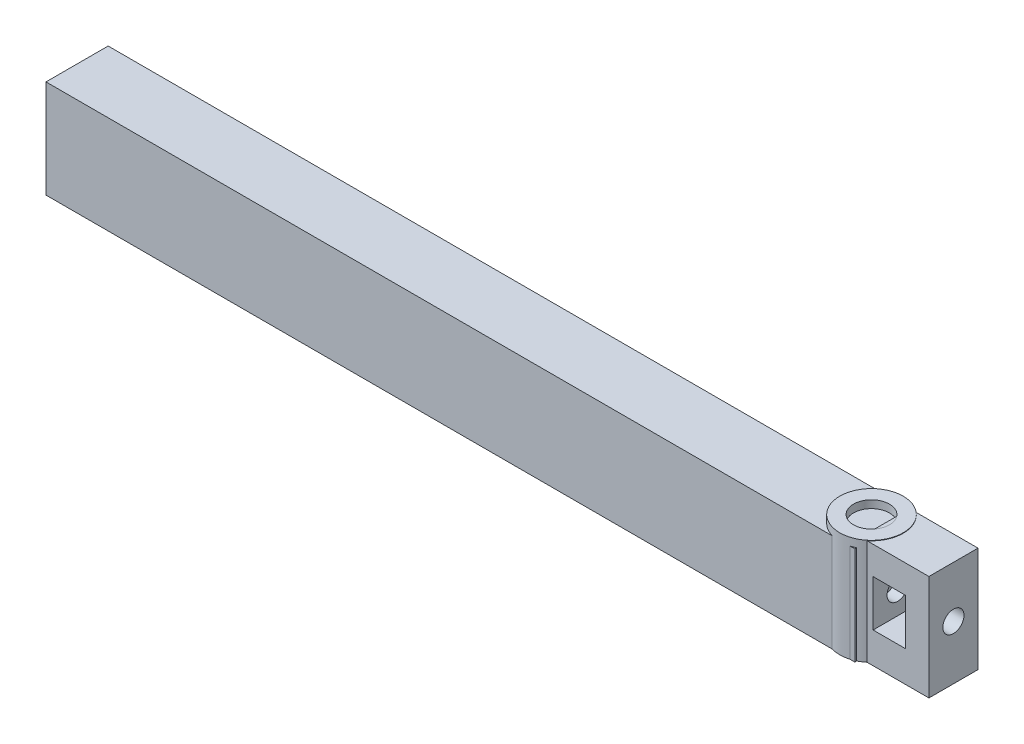
ISO-10303-21;
HEADER;
FILE_DESCRIPTION(('STEP AP214'),'2;1');
FILE_NAME('part.step','',(''),(''),'','','');
FILE_SCHEMA(('AUTOMOTIVE_DESIGN { 1 0 10303 214 1 1 1 1 }'));
ENDSEC;
DATA;
#1=APPLICATION_CONTEXT('core data for automotive mechanical design processes');
#2=APPLICATION_PROTOCOL_DEFINITION('international standard','automotive_design',2000,#1);
#3=PRODUCT_CONTEXT('',#1,'mechanical');
#4=PRODUCT('Part','Part','',(#3));
#5=PRODUCT_RELATED_PRODUCT_CATEGORY('part','',(#4));
#6=PRODUCT_DEFINITION_FORMATION('','',#4);
#7=PRODUCT_DEFINITION_CONTEXT('part definition',#1,'design');
#8=PRODUCT_DEFINITION('design','',#6,#7);
#9=PRODUCT_DEFINITION_SHAPE('','',#8);
#10=(LENGTH_UNIT() NAMED_UNIT(*) SI_UNIT(.MILLI.,.METRE.));
#11=(NAMED_UNIT(*) PLANE_ANGLE_UNIT() SI_UNIT($,.RADIAN.));
#12=(NAMED_UNIT(*) SI_UNIT($,.STERADIAN.) SOLID_ANGLE_UNIT());
#13=UNCERTAINTY_MEASURE_WITH_UNIT(LENGTH_MEASURE(1.E-05),#10,'distance_accuracy_value','');
#14=(GEOMETRIC_REPRESENTATION_CONTEXT(3) GLOBAL_UNCERTAINTY_ASSIGNED_CONTEXT((#13)) GLOBAL_UNIT_ASSIGNED_CONTEXT((#10,
#11,#12)) REPRESENTATION_CONTEXT('',''));
#15=CARTESIAN_POINT('',(0.,0.,0.));
#16=DIRECTION('',(0.,0.,1.));
#17=DIRECTION('',(1.,0.,0.));
#18=AXIS2_PLACEMENT_3D('',#15,#16,#17);
#19=CARTESIAN_POINT('',(0.,20.,0.));
#20=DIRECTION('',(0.,-1.,0.));
#21=DIRECTION('',(0.,0.,-1.));
#22=AXIS2_PLACEMENT_3D('',#19,#20,#21);
#23=CYLINDRICAL_SURFACE('',#22,6.);
#24=CARTESIAN_POINT('',(0.,20.,0.));
#25=DIRECTION('',(0.,1.,0.));
#26=DIRECTION('',(0.,0.,1.));
#27=AXIS2_PLACEMENT_3D('',#24,#25,#26);
#28=CIRCLE('',#27,6.);
#29=CARTESIAN_POINT('',(0.,20.,6.));
#30=VERTEX_POINT('',#29);
#31=EDGE_CURVE('E297',#30,#30,#28,.T.);
#32=ORIENTED_EDGE('',*,*,#31,.F.);
#33=EDGE_LOOP('',(#32));
#34=FACE_BOUND('',#33,.T.);
#35=DIRECTION('',(0.,-1.,0.));
#36=VECTOR('',#35,1.);
#37=CARTESIAN_POINT('',(-0.306093006545225,20.,-5.99218716925165));
#38=LINE('',#37,#36);
#39=CARTESIAN_POINT('',(-0.306093006545225,18.5514177143489,-5.99218716925165));
#40=VERTEX_POINT('',#39);
#41=CARTESIAN_POINT('',(-0.30609300654528,0.,-5.99218716925165));
#42=VERTEX_POINT('',#41);
#43=EDGE_CURVE('E195',#40,#42,#38,.T.);
#44=ORIENTED_EDGE('',*,*,#43,.F.);
#45=CARTESIAN_POINT('',(0.,18.5514177143489,0.));
#46=DIRECTION('',(0.,-1.,0.));
#47=DIRECTION('',(0.,0.,-1.));
#48=AXIS2_PLACEMENT_3D('',#45,#46,#47);
#49=CIRCLE('',#48,6.);
#50=CARTESIAN_POINT('',(-1.66626200895293,18.5514177143489,5.76398914967058));
#51=VERTEX_POINT('',#50);
#52=EDGE_CURVE('E49',#51,#40,#49,.T.);
#53=ORIENTED_EDGE('',*,*,#52,.F.);
#54=DIRECTION('',(0.,-1.,0.));
#55=VECTOR('',#54,1.);
#56=CARTESIAN_POINT('',(-1.66626200895293,20.,5.76398914967058));
#57=LINE('',#56,#55);
#58=CARTESIAN_POINT('',(-1.66626200895293,0.,5.76398914967058));
#59=VERTEX_POINT('',#58);
#60=EDGE_CURVE('E211',#59,#51,#57,.F.);
#61=ORIENTED_EDGE('',*,*,#60,.F.);
#62=CARTESIAN_POINT('',(0.,0.,0.));
#63=DIRECTION('',(0.,1.,0.));
#64=DIRECTION('',(0.,0.,1.));
#65=AXIS2_PLACEMENT_3D('',#62,#63,#64);
#66=CIRCLE('',#65,6.);
#67=CARTESIAN_POINT('',(1.66626200895293,0.,5.76398914967058));
#68=VERTEX_POINT('',#67);
#69=EDGE_CURVE('E399',#59,#68,#66,.T.);
#70=ORIENTED_EDGE('',*,*,#69,.T.);
#71=DIRECTION('',(0.,-1.,0.));
#72=VECTOR('',#71,1.);
#73=CARTESIAN_POINT('',(1.66626200895293,20.,5.76398914967058));
#74=LINE('',#73,#72);
#75=CARTESIAN_POINT('',(1.66626200895293,18.5514177143489,5.76398914967058));
#76=VERTEX_POINT('',#75);
#77=EDGE_CURVE('E213',#76,#68,#74,.T.);
#78=ORIENTED_EDGE('',*,*,#77,.F.);
#79=CARTESIAN_POINT('',(2.6,18.5514177143489,5.40740233383831));
#80=VERTEX_POINT('',#79);
#81=EDGE_CURVE('E204',#80,#76,#49,.T.);
#82=ORIENTED_EDGE('',*,*,#81,.F.);
#83=DIRECTION('',(0.,-1.,0.));
#84=VECTOR('',#83,1.);
#85=CARTESIAN_POINT('',(2.6,20.,5.40740233383831));
#86=LINE('',#85,#84);
#87=CARTESIAN_POINT('',(2.6,0.,5.40740233383831));
#88=VERTEX_POINT('',#87);
#89=EDGE_CURVE('E205',#88,#80,#86,.F.);
#90=ORIENTED_EDGE('',*,*,#89,.F.);
#91=CARTESIAN_POINT('',(3.80639618584468,0.,4.63803278086594));
#92=VERTEX_POINT('',#91);
#93=EDGE_CURVE('E296',#88,#92,#66,.T.);
#94=ORIENTED_EDGE('',*,*,#93,.T.);
#95=DIRECTION('',(0.,-1.,0.));
#96=VECTOR('',#95,1.);
#97=CARTESIAN_POINT('',(3.80639618584469,20.,4.63803278086594));
#98=LINE('',#97,#96);
#99=CARTESIAN_POINT('',(3.80639618584469,19.9099600410235,4.63803278086594));
#100=VERTEX_POINT('',#99);
#101=EDGE_CURVE('E283',#92,#100,#98,.F.);
#102=ORIENTED_EDGE('',*,*,#101,.T.);
#103=CARTESIAN_POINT('',(0.,19.9099600410235,0.));
#104=DIRECTION('',(0.,1.,0.));
#105=DIRECTION('',(0.,0.,1.));
#106=AXIS2_PLACEMENT_3D('',#103,#104,#105);
#107=CIRCLE('',#106,6.);
#108=CARTESIAN_POINT('',(3.79364393830497,19.9099600410235,-4.64846917483186));
#109=VERTEX_POINT('',#108);
#110=EDGE_CURVE('E273',#100,#109,#107,.T.);
#111=ORIENTED_EDGE('',*,*,#110,.T.);
#112=DIRECTION('',(0.,-1.,0.));
#113=VECTOR('',#112,1.);
#114=CARTESIAN_POINT('',(3.79364393830497,20.,-4.64846917483186));
#115=LINE('',#114,#113);
#116=CARTESIAN_POINT('',(3.79364393830497,0.,-4.64846917483186));
#117=VERTEX_POINT('',#116);
#118=EDGE_CURVE('E285',#109,#117,#115,.T.);
#119=ORIENTED_EDGE('',*,*,#118,.T.);
#120=CARTESIAN_POINT('',(2.6,0.,-5.40740233383831));
#121=VERTEX_POINT('',#120);
#122=EDGE_CURVE('E301',#117,#121,#66,.T.);
#123=ORIENTED_EDGE('',*,*,#122,.T.);
#124=DIRECTION('',(0.,-1.,0.));
#125=VECTOR('',#124,1.);
#126=CARTESIAN_POINT('',(2.6,20.,-5.40740233383831));
#127=LINE('',#126,#125);
#128=CARTESIAN_POINT('',(2.6,18.5514177143489,-5.40740233383831));
#129=VERTEX_POINT('',#128);
#130=EDGE_CURVE('E208',#129,#121,#127,.T.);
#131=ORIENTED_EDGE('',*,*,#130,.F.);
#132=CARTESIAN_POINT('',(0.306093006545225,18.5514177143489,-5.99218716925165));
#133=VERTEX_POINT('',#132);
#134=EDGE_CURVE('E56',#133,#129,#49,.T.);
#135=ORIENTED_EDGE('',*,*,#134,.F.);
#136=DIRECTION('',(0.,-1.,0.));
#137=VECTOR('',#136,1.);
#138=CARTESIAN_POINT('',(0.306093006545225,20.,-5.99218716925165));
#139=LINE('',#138,#137);
#140=CARTESIAN_POINT('',(0.30609300654528,0.,-5.99218716925165));
#141=VERTEX_POINT('',#140);
#142=EDGE_CURVE('E216',#141,#133,#139,.F.);
#143=ORIENTED_EDGE('',*,*,#142,.F.);
#144=EDGE_CURVE('E303',#141,#42,#66,.T.);
#145=ORIENTED_EDGE('',*,*,#144,.T.);
#146=EDGE_LOOP('',(#44,#53,#61,#70,#78,#82,#90,#94,#102,#111,#119,#123,#131,#135,#143,#145));
#147=FACE_BOUND('',#146,.T.);
#148=ADVANCED_FACE('F35',(#34,#147),#23,.T.);
#149=CARTESIAN_POINT('',(0.,6.45,0.));
#150=DIRECTION('',(0.,1.,0.));
#151=DIRECTION('',(0.,0.,1.));
#152=AXIS2_PLACEMENT_3D('',#149,#150,#151);
#153=CYLINDRICAL_SURFACE('',#152,3.4);
#154=CARTESIAN_POINT('',(0.,20.,0.));
#155=DIRECTION('',(0.,1.,0.));
#156=DIRECTION('',(0.,0.,1.));
#157=AXIS2_PLACEMENT_3D('',#154,#155,#156);
#158=CIRCLE('',#157,3.4);
#159=CARTESIAN_POINT('',(0.,20.,3.4));
#160=VERTEX_POINT('',#159);
#161=EDGE_CURVE('E293',#160,#160,#158,.T.);
#162=ORIENTED_EDGE('',*,*,#161,.T.);
#163=EDGE_LOOP('',(#162));
#164=FACE_BOUND('',#163,.T.);
#165=CARTESIAN_POINT('',(0.,18.5514177143489,0.));
#166=DIRECTION('',(0.,-1.,0.));
#167=DIRECTION('',(0.,0.,-1.));
#168=AXIS2_PLACEMENT_3D('',#165,#166,#167);
#169=CIRCLE('',#168,3.4);
#170=CARTESIAN_POINT('',(2.6,18.5514177143489,-2.19089023002067));
#171=VERTEX_POINT('',#170);
#172=CARTESIAN_POINT('',(2.6,18.5514177143489,2.19089023002067));
#173=VERTEX_POINT('',#172);
#174=EDGE_CURVE('E196',#171,#173,#169,.F.);
#175=ORIENTED_EDGE('',*,*,#174,.F.);
#176=DIRECTION('',(0.,1.,0.));
#177=VECTOR('',#176,1.);
#178=CARTESIAN_POINT('',(2.6,6.45,-2.19089023002067));
#179=LINE('',#178,#177);
#180=CARTESIAN_POINT('',(2.6,19.9099600410235,-2.19089023002066));
#181=VERTEX_POINT('',#180);
#182=EDGE_CURVE('E288',#171,#181,#179,.T.);
#183=ORIENTED_EDGE('',*,*,#182,.T.);
#184=CARTESIAN_POINT('',(0.,19.9099600410235,0.));
#185=DIRECTION('',(0.,1.,0.));
#186=DIRECTION('',(0.,0.,1.));
#187=AXIS2_PLACEMENT_3D('',#184,#185,#186);
#188=CIRCLE('',#187,3.4);
#189=CARTESIAN_POINT('',(2.6,19.9099600410235,2.19089023002066));
#190=VERTEX_POINT('',#189);
#191=EDGE_CURVE('E300',#181,#190,#188,.F.);
#192=ORIENTED_EDGE('',*,*,#191,.T.);
#193=DIRECTION('',(0.,1.,0.));
#194=VECTOR('',#193,1.);
#195=CARTESIAN_POINT('',(2.6,6.45,2.19089023002067));
#196=LINE('',#195,#194);
#197=EDGE_CURVE('E290',#190,#173,#196,.F.);
#198=ORIENTED_EDGE('',*,*,#197,.T.);
#199=EDGE_LOOP('',(#175,#183,#192,#198));
#200=FACE_BOUND('',#199,.T.);
#201=ADVANCED_FACE('F344',(#164,#200),#153,.F.);
#202=CARTESIAN_POINT('',(2.6,4.71,3.57158819939229));
#203=DIRECTION('',(-1.,0.,0.));
#204=DIRECTION('',(0.,0.,1.));
#205=AXIS2_PLACEMENT_3D('',#202,#203,#204);
#206=PLANE('',#205);
#207=ORIENTED_EDGE('',*,*,#182,.F.);
#208=DIRECTION('',(0.,0.,1.));
#209=VECTOR('',#208,1.);
#210=CARTESIAN_POINT('',(2.6,18.5514177143489,3.57158819939229));
#211=LINE('',#210,#209);
#212=EDGE_CURVE('E11',#171,#173,#211,.T.);
#213=ORIENTED_EDGE('',*,*,#212,.T.);
#214=ORIENTED_EDGE('',*,*,#197,.F.);
#215=DIRECTION('',(0.,0.,-1.));
#216=VECTOR('',#215,1.);
#217=CARTESIAN_POINT('',(2.6,19.9099600410235,-4.64846917483186));
#218=LINE('',#217,#216);
#219=EDGE_CURVE('E254',#190,#181,#218,.T.);
#220=ORIENTED_EDGE('',*,*,#219,.T.);
#221=EDGE_LOOP('',(#207,#213,#214,#220));
#222=FACE_BOUND('',#221,.T.);
#223=ADVANCED_FACE('F349',(#222),#206,.T.);
#224=CARTESIAN_POINT('',(15.5,19.9099600410235,-4.64846917483186));
#225=DIRECTION('',(0.,0.,-1.));
#226=DIRECTION('',(-1.,0.,0.));
#227=AXIS2_PLACEMENT_3D('',#224,#225,#226);
#228=PLANE('',#227);
#229=ORIENTED_EDGE('',*,*,#118,.F.);
#230=DIRECTION('',(-1.,0.,0.));
#231=VECTOR('',#230,1.);
#232=CARTESIAN_POINT('',(15.5,19.9099600410235,-4.64846917483186));
#233=LINE('',#232,#231);
#234=CARTESIAN_POINT('',(15.5,19.9099600410235,-4.64846917483186));
#235=VERTEX_POINT('',#234);
#236=EDGE_CURVE('E270',#235,#109,#233,.T.);
#237=ORIENTED_EDGE('',*,*,#236,.F.);
#238=DIRECTION('',(0.,-1.,0.));
#239=VECTOR('',#238,1.);
#240=CARTESIAN_POINT('',(15.5,19.9099600410235,-4.64846917483186));
#241=LINE('',#240,#239);
#242=CARTESIAN_POINT('',(15.5,0.,-4.64846917483186));
#243=VERTEX_POINT('',#242);
#244=EDGE_CURVE('E255',#235,#243,#241,.T.);
#245=ORIENTED_EDGE('',*,*,#244,.T.);
#246=DIRECTION('',(-1.,0.,0.));
#247=VECTOR('',#246,1.);
#248=CARTESIAN_POINT('',(15.5,0.,-4.64846917483186));
#249=LINE('',#248,#247);
#250=EDGE_CURVE('E267',#243,#117,#249,.T.);
#251=ORIENTED_EDGE('',*,*,#250,.T.);
#252=EDGE_LOOP('',(#229,#237,#245,#251));
#253=FACE_BOUND('',#252,.T.);
#254=DIRECTION('',(0.,1.,0.));
#255=VECTOR('',#254,1.);
#256=CARTESIAN_POINT('',(11.0634302269429,19.9099600410235,-4.64846917483186));
#257=LINE('',#256,#255);
#258=CARTESIAN_POINT('',(11.0634302269429,5.86192553685862,-4.64846917483186));
#259=VERTEX_POINT('',#258);
#260=CARTESIAN_POINT('',(11.0634302269429,14.6119255368586,-4.64846917483186));
#261=VERTEX_POINT('',#260);
#262=EDGE_CURVE('E234',#259,#261,#257,.T.);
#263=ORIENTED_EDGE('',*,*,#262,.T.);
#264=DIRECTION('',(-1.,0.,0.));
#265=VECTOR('',#264,1.);
#266=CARTESIAN_POINT('',(15.5,14.6119255368586,-4.64846917483186));
#267=LINE('',#266,#265);
#268=CARTESIAN_POINT('',(4.94343022694287,14.6119255368586,-4.64846917483186));
#269=VERTEX_POINT('',#268);
#270=EDGE_CURVE('E247',#261,#269,#267,.T.);
#271=ORIENTED_EDGE('',*,*,#270,.T.);
#272=DIRECTION('',(0.,-1.,0.));
#273=VECTOR('',#272,1.);
#274=CARTESIAN_POINT('',(4.94343022694287,19.9099600410235,-4.64846917483186));
#275=LINE('',#274,#273);
#276=CARTESIAN_POINT('',(4.94343022694287,5.86192553685862,-4.64846917483186));
#277=VERTEX_POINT('',#276);
#278=EDGE_CURVE('E241',#269,#277,#275,.T.);
#279=ORIENTED_EDGE('',*,*,#278,.T.);
#280=DIRECTION('',(1.,0.,0.));
#281=VECTOR('',#280,1.);
#282=CARTESIAN_POINT('',(15.5,5.86192553685862,-4.64846917483186));
#283=LINE('',#282,#281);
#284=EDGE_CURVE('E244',#277,#259,#283,.T.);
#285=ORIENTED_EDGE('',*,*,#284,.T.);
#286=EDGE_LOOP('',(#263,#271,#279,#285));
#287=FACE_BOUND('',#286,.T.);
#288=ADVANCED_FACE('F326',(#253,#287),#228,.T.);
#289=CARTESIAN_POINT('',(15.5,19.9099600410235,4.63803278086594));
#290=DIRECTION('',(0.,0.,1.));
#291=DIRECTION('',(0.,-1.,0.));
#292=AXIS2_PLACEMENT_3D('',#289,#290,#291);
#293=PLANE('',#292);
#294=ORIENTED_EDGE('',*,*,#101,.F.);
#295=DIRECTION('',(-1.,0.,0.));
#296=VECTOR('',#295,1.);
#297=CARTESIAN_POINT('',(15.5,0.,4.63803278086594));
#298=LINE('',#297,#296);
#299=CARTESIAN_POINT('',(15.5,0.,4.63803278086594));
#300=VERTEX_POINT('',#299);
#301=EDGE_CURVE('E277',#300,#92,#298,.T.);
#302=ORIENTED_EDGE('',*,*,#301,.F.);
#303=DIRECTION('',(0.,1.,0.));
#304=VECTOR('',#303,1.);
#305=CARTESIAN_POINT('',(15.5,19.9099600410235,4.63803278086594));
#306=LINE('',#305,#304);
#307=CARTESIAN_POINT('',(15.5,19.9099600410235,4.63803278086594));
#308=VERTEX_POINT('',#307);
#309=EDGE_CURVE('E261',#300,#308,#306,.T.);
#310=ORIENTED_EDGE('',*,*,#309,.T.);
#311=DIRECTION('',(-1.,0.,0.));
#312=VECTOR('',#311,1.);
#313=CARTESIAN_POINT('',(15.5,19.9099600410235,4.63803278086594));
#314=LINE('',#313,#312);
#315=EDGE_CURVE('E274',#308,#100,#314,.T.);
#316=ORIENTED_EDGE('',*,*,#315,.T.);
#317=EDGE_LOOP('',(#294,#302,#310,#316));
#318=FACE_BOUND('',#317,.T.);
#319=DIRECTION('',(0.,1.,0.));
#320=VECTOR('',#319,1.);
#321=CARTESIAN_POINT('',(4.94343022694287,19.9099600410235,4.63803278086594));
#322=LINE('',#321,#320);
#323=CARTESIAN_POINT('',(4.94343022694287,5.86192553685862,4.63803278086594));
#324=VERTEX_POINT('',#323);
#325=CARTESIAN_POINT('',(4.94343022694287,14.6119255368586,4.63803278086594));
#326=VERTEX_POINT('',#325);
#327=EDGE_CURVE('E238',#324,#326,#322,.T.);
#328=ORIENTED_EDGE('',*,*,#327,.T.);
#329=DIRECTION('',(1.,0.,0.));
#330=VECTOR('',#329,1.);
#331=CARTESIAN_POINT('',(15.5,14.6119255368586,4.63803278086594));
#332=LINE('',#331,#330);
#333=CARTESIAN_POINT('',(11.0634302269429,14.6119255368586,4.63803278086594));
#334=VERTEX_POINT('',#333);
#335=EDGE_CURVE('E42',#326,#334,#332,.T.);
#336=ORIENTED_EDGE('',*,*,#335,.T.);
#337=DIRECTION('',(0.,-1.,0.));
#338=VECTOR('',#337,1.);
#339=CARTESIAN_POINT('',(11.0634302269429,19.9099600410235,4.63803278086594));
#340=LINE('',#339,#338);
#341=CARTESIAN_POINT('',(11.0634302269429,5.86192553685862,4.63803278086594));
#342=VERTEX_POINT('',#341);
#343=EDGE_CURVE('E231',#334,#342,#340,.T.);
#344=ORIENTED_EDGE('',*,*,#343,.T.);
#345=DIRECTION('',(-1.,0.,0.));
#346=VECTOR('',#345,1.);
#347=CARTESIAN_POINT('',(15.5,5.86192553685862,4.63803278086594));
#348=LINE('',#347,#346);
#349=EDGE_CURVE('E306',#342,#324,#348,.T.);
#350=ORIENTED_EDGE('',*,*,#349,.T.);
#351=EDGE_LOOP('',(#328,#336,#344,#350));
#352=FACE_BOUND('',#351,.T.);
#353=ADVANCED_FACE('F316',(#318,#352),#293,.T.);
#354=CARTESIAN_POINT('',(1.6,10.2369255368586,0.));
#355=DIRECTION('',(1.,0.,0.));
#356=DIRECTION('',(0.,0.,-1.));
#357=AXIS2_PLACEMENT_3D('',#354,#355,#356);
#358=CYLINDRICAL_SURFACE('',#357,2.);
#359=CARTESIAN_POINT('',(2.6,10.2369255368586,0.));
#360=DIRECTION('',(-1.,0.,0.));
#361=DIRECTION('',(0.,0.,1.));
#362=AXIS2_PLACEMENT_3D('',#359,#360,#361);
#363=CIRCLE('',#362,2.);
#364=CARTESIAN_POINT('',(2.6,10.2369255368586,2.));
#365=VERTEX_POINT('',#364);
#366=EDGE_CURVE('E251',#365,#365,#363,.F.);
#367=ORIENTED_EDGE('',*,*,#366,.F.);
#368=EDGE_LOOP('',(#367));
#369=FACE_BOUND('',#368,.T.);
#370=CARTESIAN_POINT('',(4.94343022694287,10.2369255368586,0.));
#371=DIRECTION('',(1.,0.,0.));
#372=DIRECTION('',(0.,0.,-1.));
#373=AXIS2_PLACEMENT_3D('',#370,#371,#372);
#374=CIRCLE('',#373,2.);
#375=CARTESIAN_POINT('',(4.94343022694287,10.2369255368586,-2.));
#376=VERTEX_POINT('',#375);
#377=EDGE_CURVE('E237',#376,#376,#374,.T.);
#378=ORIENTED_EDGE('',*,*,#377,.T.);
#379=EDGE_LOOP('',(#378));
#380=FACE_BOUND('',#379,.T.);
#381=ADVANCED_FACE('F449',(#369,#380),#358,.F.);
#382=CARTESIAN_POINT('',(15.5,10.2369255368586,0.));
#383=DIRECTION('',(-1.,0.,0.));
#384=DIRECTION('',(0.,0.,1.));
#385=AXIS2_PLACEMENT_3D('',#382,#383,#384);
#386=CIRCLE('',#385,2.);
#387=CARTESIAN_POINT('',(15.5,10.2369255368586,2.));
#388=VERTEX_POINT('',#387);
#389=EDGE_CURVE('E250',#388,#388,#386,.F.);
#390=ORIENTED_EDGE('',*,*,#389,.T.);
#391=EDGE_LOOP('',(#390));
#392=FACE_BOUND('',#391,.T.);
#393=CARTESIAN_POINT('',(11.0634302269429,10.2369255368586,0.));
#394=DIRECTION('',(-1.,0.,0.));
#395=DIRECTION('',(0.,0.,1.));
#396=AXIS2_PLACEMENT_3D('',#393,#394,#395);
#397=CIRCLE('',#396,2.);
#398=CARTESIAN_POINT('',(11.0634302269429,10.2369255368586,2.));
#399=VERTEX_POINT('',#398);
#400=EDGE_CURVE('E230',#399,#399,#397,.T.);
#401=ORIENTED_EDGE('',*,*,#400,.T.);
#402=EDGE_LOOP('',(#401));
#403=FACE_BOUND('',#402,.T.);
#404=ADVANCED_FACE('F455',(#392,#403),#358,.F.);
#405=CARTESIAN_POINT('',(0.,20.,0.));
#406=DIRECTION('',(0.,1.,0.));
#407=DIRECTION('',(0.,0.,1.));
#408=AXIS2_PLACEMENT_3D('',#405,#406,#407);
#409=PLANE('',#408);
#410=ORIENTED_EDGE('',*,*,#161,.F.);
#411=EDGE_LOOP('',(#410));
#412=FACE_BOUND('',#411,.T.);
#413=ORIENTED_EDGE('',*,*,#31,.T.);
#414=EDGE_LOOP('',(#413));
#415=FACE_BOUND('',#414,.T.);
#416=ADVANCED_FACE('F465',(#412,#415),#409,.T.);
#417=CARTESIAN_POINT('',(0.,0.,0.));
#418=DIRECTION('',(0.,1.,0.));
#419=DIRECTION('',(0.,0.,1.));
#420=AXIS2_PLACEMENT_3D('',#417,#418,#419);
#421=PLANE('',#420);
#422=ORIENTED_EDGE('',*,*,#69,.F.);
#423=DIRECTION('',(1.,0.,0.));
#424=VECTOR('',#423,1.);
#425=CARTESIAN_POINT('',(-150.4,0.,5.76398914967058));
#426=LINE('',#425,#424);
#427=CARTESIAN_POINT('',(-150.4,0.,5.76398914967058));
#428=VERTEX_POINT('',#427);
#429=EDGE_CURVE('E178',#428,#59,#426,.T.);
#430=ORIENTED_EDGE('',*,*,#429,.F.);
#431=DIRECTION('',(0.,0.,1.));
#432=VECTOR('',#431,1.);
#433=CARTESIAN_POINT('',(-150.4,0.,-5.99218716925165));
#434=LINE('',#433,#432);
#435=CARTESIAN_POINT('',(-150.4,0.,-5.99218716925165));
#436=VERTEX_POINT('',#435);
#437=EDGE_CURVE('E170',#436,#428,#434,.T.);
#438=ORIENTED_EDGE('',*,*,#437,.F.);
#439=DIRECTION('',(1.,0.,0.));
#440=VECTOR('',#439,1.);
#441=CARTESIAN_POINT('',(-150.4,0.,-5.99218716925165));
#442=LINE('',#441,#440);
#443=EDGE_CURVE('E176',#436,#42,#442,.T.);
#444=ORIENTED_EDGE('',*,*,#443,.T.);
#445=ORIENTED_EDGE('',*,*,#144,.F.);
#446=CARTESIAN_POINT('',(2.6,0.,-5.99218716925165));
#447=VERTEX_POINT('',#446);
#448=EDGE_CURVE('E197',#141,#447,#442,.T.);
#449=ORIENTED_EDGE('',*,*,#448,.T.);
#450=DIRECTION('',(0.,0.,1.));
#451=VECTOR('',#450,1.);
#452=CARTESIAN_POINT('',(2.6,0.,-5.99218716925165));
#453=LINE('',#452,#451);
#454=EDGE_CURVE('E378',#447,#121,#453,.T.);
#455=ORIENTED_EDGE('',*,*,#454,.T.);
#456=ORIENTED_EDGE('',*,*,#122,.F.);
#457=ORIENTED_EDGE('',*,*,#250,.F.);
#458=DIRECTION('',(0.,0.,1.));
#459=VECTOR('',#458,1.);
#460=CARTESIAN_POINT('',(15.5,0.,-4.64846917483186));
#461=LINE('',#460,#459);
#462=EDGE_CURVE('E258',#243,#300,#461,.T.);
#463=ORIENTED_EDGE('',*,*,#462,.T.);
#464=ORIENTED_EDGE('',*,*,#301,.T.);
#465=ORIENTED_EDGE('',*,*,#93,.F.);
#466=CARTESIAN_POINT('',(2.6,0.,5.76398914967058));
#467=VERTEX_POINT('',#466);
#468=EDGE_CURVE('E377',#88,#467,#453,.T.);
#469=ORIENTED_EDGE('',*,*,#468,.T.);
#470=EDGE_CURVE('E364',#68,#467,#426,.T.);
#471=ORIENTED_EDGE('',*,*,#470,.F.);
#472=EDGE_LOOP('',(#422,#430,#438,#444,#445,#449,#455,#456,#457,#463,#464,#465,#469,#471));
#473=FACE_BOUND('',#472,.T.);
#474=ADVANCED_FACE('F173',(#473),#421,.F.);
#475=CARTESIAN_POINT('',(15.5,19.9099600410235,-4.64846917483186));
#476=DIRECTION('',(0.,1.,0.));
#477=DIRECTION('',(0.,0.,1.));
#478=AXIS2_PLACEMENT_3D('',#475,#476,#477);
#479=PLANE('',#478);
#480=ORIENTED_EDGE('',*,*,#191,.F.);
#481=ORIENTED_EDGE('',*,*,#219,.F.);
#482=EDGE_LOOP('',(#480,#481));
#483=FACE_BOUND('',#482,.T.);
#484=ADVANCED_FACE('F469',(#483),#479,.T.);
#485=ORIENTED_EDGE('',*,*,#110,.F.);
#486=ORIENTED_EDGE('',*,*,#315,.F.);
#487=DIRECTION('',(0.,0.,-1.));
#488=VECTOR('',#487,1.);
#489=CARTESIAN_POINT('',(15.5,19.9099600410235,-4.64846917483186));
#490=LINE('',#489,#488);
#491=EDGE_CURVE('E264',#308,#235,#490,.T.);
#492=ORIENTED_EDGE('',*,*,#491,.T.);
#493=ORIENTED_EDGE('',*,*,#236,.T.);
#494=EDGE_LOOP('',(#485,#486,#492,#493));
#495=FACE_BOUND('',#494,.T.);
#496=ADVANCED_FACE('F446',(#495),#479,.T.);
#497=CARTESIAN_POINT('',(15.5,0.,0.));
#498=DIRECTION('',(-1.,0.,0.));
#499=DIRECTION('',(0.,0.,1.));
#500=AXIS2_PLACEMENT_3D('',#497,#498,#499);
#501=PLANE('',#500);
#502=ORIENTED_EDGE('',*,*,#389,.F.);
#503=EDGE_LOOP('',(#502));
#504=FACE_BOUND('',#503,.T.);
#505=ORIENTED_EDGE('',*,*,#244,.F.);
#506=ORIENTED_EDGE('',*,*,#491,.F.);
#507=ORIENTED_EDGE('',*,*,#309,.F.);
#508=ORIENTED_EDGE('',*,*,#462,.F.);
#509=EDGE_LOOP('',(#505,#506,#507,#508));
#510=FACE_BOUND('',#509,.T.);
#511=ADVANCED_FACE('F442',(#504,#510),#501,.F.);
#512=CARTESIAN_POINT('',(4.94343022694287,14.6119255368586,10.));
#513=DIRECTION('',(0.,-1.,0.));
#514=DIRECTION('',(0.,0.,-1.));
#515=AXIS2_PLACEMENT_3D('',#512,#513,#514);
#516=PLANE('',#515);
#517=DIRECTION('',(0.,0.,-1.));
#518=VECTOR('',#517,1.);
#519=CARTESIAN_POINT('',(11.0634302269429,14.6119255368586,10.));
#520=LINE('',#519,#518);
#521=EDGE_CURVE('E228',#334,#261,#520,.T.);
#522=ORIENTED_EDGE('',*,*,#521,.F.);
#523=ORIENTED_EDGE('',*,*,#335,.F.);
#524=DIRECTION('',(0.,0.,-1.));
#525=VECTOR('',#524,1.);
#526=CARTESIAN_POINT('',(4.94343022694287,14.6119255368586,10.));
#527=LINE('',#526,#525);
#528=EDGE_CURVE('E225',#326,#269,#527,.T.);
#529=ORIENTED_EDGE('',*,*,#528,.T.);
#530=ORIENTED_EDGE('',*,*,#270,.F.);
#531=EDGE_LOOP('',(#522,#523,#529,#530));
#532=FACE_BOUND('',#531,.T.);
#533=ADVANCED_FACE('F320',(#532),#516,.T.);
#534=CARTESIAN_POINT('',(4.94343022694287,5.86192553685862,10.));
#535=DIRECTION('',(1.,0.,0.));
#536=DIRECTION('',(0.,0.,-1.));
#537=AXIS2_PLACEMENT_3D('',#534,#535,#536);
#538=PLANE('',#537);
#539=ORIENTED_EDGE('',*,*,#377,.F.);
#540=EDGE_LOOP('',(#539));
#541=FACE_BOUND('',#540,.T.);
#542=ORIENTED_EDGE('',*,*,#528,.F.);
#543=ORIENTED_EDGE('',*,*,#327,.F.);
#544=DIRECTION('',(0.,0.,-1.));
#545=VECTOR('',#544,1.);
#546=CARTESIAN_POINT('',(4.94343022694287,5.86192553685862,10.));
#547=LINE('',#546,#545);
#548=EDGE_CURVE('E222',#324,#277,#547,.T.);
#549=ORIENTED_EDGE('',*,*,#548,.T.);
#550=ORIENTED_EDGE('',*,*,#278,.F.);
#551=EDGE_LOOP('',(#542,#543,#549,#550));
#552=FACE_BOUND('',#551,.T.);
#553=ADVANCED_FACE('F323',(#541,#552),#538,.T.);
#554=CARTESIAN_POINT('',(4.94343022694287,5.86192553685862,10.));
#555=DIRECTION('',(0.,1.,0.));
#556=DIRECTION('',(0.,0.,1.));
#557=AXIS2_PLACEMENT_3D('',#554,#555,#556);
#558=PLANE('',#557);
#559=ORIENTED_EDGE('',*,*,#548,.F.);
#560=ORIENTED_EDGE('',*,*,#349,.F.);
#561=DIRECTION('',(0.,0.,-1.));
#562=VECTOR('',#561,1.);
#563=CARTESIAN_POINT('',(11.0634302269429,5.86192553685862,10.));
#564=LINE('',#563,#562);
#565=EDGE_CURVE('E219',#342,#259,#564,.T.);
#566=ORIENTED_EDGE('',*,*,#565,.T.);
#567=ORIENTED_EDGE('',*,*,#284,.F.);
#568=EDGE_LOOP('',(#559,#560,#566,#567));
#569=FACE_BOUND('',#568,.T.);
#570=ADVANCED_FACE('F331',(#569),#558,.T.);
#571=CARTESIAN_POINT('',(11.0634302269429,10.2369255368586,10.));
#572=DIRECTION('',(-1.,0.,0.));
#573=DIRECTION('',(0.,0.,1.));
#574=AXIS2_PLACEMENT_3D('',#571,#572,#573);
#575=PLANE('',#574);
#576=ORIENTED_EDGE('',*,*,#400,.F.);
#577=EDGE_LOOP('',(#576));
#578=FACE_BOUND('',#577,.T.);
#579=ORIENTED_EDGE('',*,*,#565,.F.);
#580=ORIENTED_EDGE('',*,*,#343,.F.);
#581=ORIENTED_EDGE('',*,*,#521,.T.);
#582=ORIENTED_EDGE('',*,*,#262,.F.);
#583=EDGE_LOOP('',(#579,#580,#581,#582));
#584=FACE_BOUND('',#583,.T.);
#585=ADVANCED_FACE('F328',(#578,#584),#575,.T.);
#586=CARTESIAN_POINT('',(-150.4,18.5514177143489,-5.99218716925165));
#587=DIRECTION('',(0.,-1.,0.));
#588=DIRECTION('',(0.,0.,-1.));
#589=AXIS2_PLACEMENT_3D('',#586,#587,#588);
#590=PLANE('',#589);
#591=ORIENTED_EDGE('',*,*,#212,.F.);
#592=ORIENTED_EDGE('',*,*,#174,.T.);
#593=EDGE_LOOP('',(#591,#592));
#594=FACE_BOUND('',#593,.T.);
#595=ADVANCED_FACE('F338',(#594),#590,.F.);
#596=CARTESIAN_POINT('',(2.6,0.,0.));
#597=DIRECTION('',(-1.,0.,0.));
#598=DIRECTION('',(0.,0.,1.));
#599=AXIS2_PLACEMENT_3D('',#596,#597,#598);
#600=PLANE('',#599);
#601=ORIENTED_EDGE('',*,*,#468,.F.);
#602=ORIENTED_EDGE('',*,*,#89,.T.);
#603=DIRECTION('',(0.,0.,-1.));
#604=VECTOR('',#603,1.);
#605=CARTESIAN_POINT('',(2.6,18.5514177143489,-5.99218716925165));
#606=LINE('',#605,#604);
#607=CARTESIAN_POINT('',(2.6,18.5514177143489,5.76398914967058));
#608=VERTEX_POINT('',#607);
#609=EDGE_CURVE('E191',#608,#80,#606,.T.);
#610=ORIENTED_EDGE('',*,*,#609,.F.);
#611=DIRECTION('',(0.,1.,0.));
#612=VECTOR('',#611,1.);
#613=CARTESIAN_POINT('',(2.6,18.5514177143489,5.76398914967058));
#614=LINE('',#613,#612);
#615=EDGE_CURVE('E380',#467,#608,#614,.T.);
#616=ORIENTED_EDGE('',*,*,#615,.F.);
#617=EDGE_LOOP('',(#601,#602,#610,#616));
#618=FACE_BOUND('',#617,.T.);
#619=ADVANCED_FACE('F396',(#618),#600,.F.);
#620=ORIENTED_EDGE('',*,*,#609,.T.);
#621=ORIENTED_EDGE('',*,*,#81,.T.);
#622=DIRECTION('',(1.,0.,0.));
#623=VECTOR('',#622,1.);
#624=CARTESIAN_POINT('',(-150.4,18.5514177143489,5.76398914967058));
#625=LINE('',#624,#623);
#626=EDGE_CURVE('E359',#76,#608,#625,.T.);
#627=ORIENTED_EDGE('',*,*,#626,.T.);
#628=EDGE_LOOP('',(#620,#621,#627));
#629=FACE_BOUND('',#628,.T.);
#630=ADVANCED_FACE('F393',(#629),#590,.F.);
#631=CARTESIAN_POINT('',(-150.4,18.5514177143489,5.76398914967058));
#632=DIRECTION('',(0.,0.,-1.));
#633=DIRECTION('',(0.,1.,0.));
#634=AXIS2_PLACEMENT_3D('',#631,#632,#633);
#635=PLANE('',#634);
#636=ORIENTED_EDGE('',*,*,#626,.F.);
#637=ORIENTED_EDGE('',*,*,#77,.T.);
#638=ORIENTED_EDGE('',*,*,#470,.T.);
#639=ORIENTED_EDGE('',*,*,#615,.T.);
#640=EDGE_LOOP('',(#636,#637,#638,#639));
#641=FACE_BOUND('',#640,.T.);
#642=ADVANCED_FACE('F400',(#641),#635,.F.);
#643=CARTESIAN_POINT('',(2.6,18.5514177143489,-5.99218716925165));
#644=VERTEX_POINT('',#643);
#645=EDGE_CURVE('E381',#129,#644,#606,.T.);
#646=ORIENTED_EDGE('',*,*,#645,.F.);
#647=ORIENTED_EDGE('',*,*,#130,.T.);
#648=ORIENTED_EDGE('',*,*,#454,.F.);
#649=DIRECTION('',(0.,-1.,0.));
#650=VECTOR('',#649,1.);
#651=CARTESIAN_POINT('',(2.6,18.5514177143489,-5.99218716925165));
#652=LINE('',#651,#650);
#653=EDGE_CURVE('E374',#644,#447,#652,.T.);
#654=ORIENTED_EDGE('',*,*,#653,.F.);
#655=EDGE_LOOP('',(#646,#647,#648,#654));
#656=FACE_BOUND('',#655,.T.);
#657=ADVANCED_FACE('F402',(#656),#600,.F.);
#658=DIRECTION('',(1.,0.,0.));
#659=VECTOR('',#658,1.);
#660=CARTESIAN_POINT('',(-150.4,18.5514177143489,-5.99218716925165));
#661=LINE('',#660,#659);
#662=EDGE_CURVE('E360',#133,#644,#661,.T.);
#663=ORIENTED_EDGE('',*,*,#662,.F.);
#664=ORIENTED_EDGE('',*,*,#134,.T.);
#665=ORIENTED_EDGE('',*,*,#645,.T.);
#666=EDGE_LOOP('',(#663,#664,#665));
#667=FACE_BOUND('',#666,.T.);
#668=ADVANCED_FACE('F408',(#667),#590,.F.);
#669=CARTESIAN_POINT('',(-150.4,18.5514177143489,-5.99218716925165));
#670=DIRECTION('',(0.,0.,1.));
#671=DIRECTION('',(0.,-1.,0.));
#672=AXIS2_PLACEMENT_3D('',#669,#670,#671);
#673=PLANE('',#672);
#674=ORIENTED_EDGE('',*,*,#448,.F.);
#675=ORIENTED_EDGE('',*,*,#142,.T.);
#676=ORIENTED_EDGE('',*,*,#662,.T.);
#677=ORIENTED_EDGE('',*,*,#653,.T.);
#678=EDGE_LOOP('',(#674,#675,#676,#677));
#679=FACE_BOUND('',#678,.T.);
#680=ADVANCED_FACE('F419',(#679),#673,.F.);
#681=CARTESIAN_POINT('',(-150.4,0.,0.));
#682=DIRECTION('',(-1.,0.,0.));
#683=DIRECTION('',(0.,0.,1.));
#684=AXIS2_PLACEMENT_3D('',#681,#682,#683);
#685=PLANE('',#684);
#686=DIRECTION('',(0.,-1.,0.));
#687=VECTOR('',#686,1.);
#688=CARTESIAN_POINT('',(-150.4,18.5514177143489,-5.99218716925165));
#689=LINE('',#688,#687);
#690=CARTESIAN_POINT('',(-150.4,18.5514177143489,-5.99218716925165));
#691=VERTEX_POINT('',#690);
#692=EDGE_CURVE('E182',#691,#436,#689,.T.);
#693=ORIENTED_EDGE('',*,*,#692,.T.);
#694=ORIENTED_EDGE('',*,*,#437,.T.);
#695=DIRECTION('',(0.,1.,0.));
#696=VECTOR('',#695,1.);
#697=CARTESIAN_POINT('',(-150.4,18.5514177143489,5.76398914967058));
#698=LINE('',#697,#696);
#699=CARTESIAN_POINT('',(-150.4,18.5514177143489,5.76398914967058));
#700=VERTEX_POINT('',#699);
#701=EDGE_CURVE('E181',#428,#700,#698,.T.);
#702=ORIENTED_EDGE('',*,*,#701,.T.);
#703=DIRECTION('',(0.,0.,-1.));
#704=VECTOR('',#703,1.);
#705=CARTESIAN_POINT('',(-150.4,18.5514177143489,-5.99218716925165));
#706=LINE('',#705,#704);
#707=EDGE_CURVE('E187',#700,#691,#706,.T.);
#708=ORIENTED_EDGE('',*,*,#707,.T.);
#709=EDGE_LOOP('',(#693,#694,#702,#708));
#710=FACE_BOUND('',#709,.T.);
#711=ADVANCED_FACE('F185',(#710),#685,.T.);
#712=EDGE_CURVE('E358',#700,#51,#625,.T.);
#713=ORIENTED_EDGE('',*,*,#712,.T.);
#714=ORIENTED_EDGE('',*,*,#52,.T.);
#715=EDGE_CURVE('E356',#691,#40,#661,.T.);
#716=ORIENTED_EDGE('',*,*,#715,.F.);
#717=ORIENTED_EDGE('',*,*,#707,.F.);
#718=EDGE_LOOP('',(#713,#714,#716,#717));
#719=FACE_BOUND('',#718,.T.);
#720=ADVANCED_FACE('F355',(#719),#590,.F.);
#721=ORIENTED_EDGE('',*,*,#429,.T.);
#722=ORIENTED_EDGE('',*,*,#60,.T.);
#723=ORIENTED_EDGE('',*,*,#712,.F.);
#724=ORIENTED_EDGE('',*,*,#701,.F.);
#725=EDGE_LOOP('',(#721,#722,#723,#724));
#726=FACE_BOUND('',#725,.T.);
#727=ADVANCED_FACE('F370',(#726),#635,.F.);
#728=ORIENTED_EDGE('',*,*,#715,.T.);
#729=ORIENTED_EDGE('',*,*,#43,.T.);
#730=ORIENTED_EDGE('',*,*,#443,.F.);
#731=ORIENTED_EDGE('',*,*,#692,.F.);
#732=EDGE_LOOP('',(#728,#729,#730,#731));
#733=FACE_BOUND('',#732,.T.);
#734=ADVANCED_FACE('F194',(#733),#673,.F.);
#735=ORIENTED_EDGE('',*,*,#366,.T.);
#736=EDGE_LOOP('',(#735));
#737=FACE_BOUND('',#736,.T.);
#738=ADVANCED_FACE('F411',(#737),#600,.F.);
#739=CLOSED_SHELL('',(#148,#201,#223,#288,#353,#381,#404,#416,#474,#484,#496,#511,#533,#553,
#570,#585,#595,#619,#630,#642,#657,#668,#680,#711,#720,#727,#734,#738));
#740=MANIFOLD_SOLID_BREP('B2',#739);
#741=ADVANCED_BREP_SHAPE_REPRESENTATION('',(#18,#740),#14);
#742=SHAPE_DEFINITION_REPRESENTATION(#9,#741);
ENDSEC;
END-ISO-10303-21;
